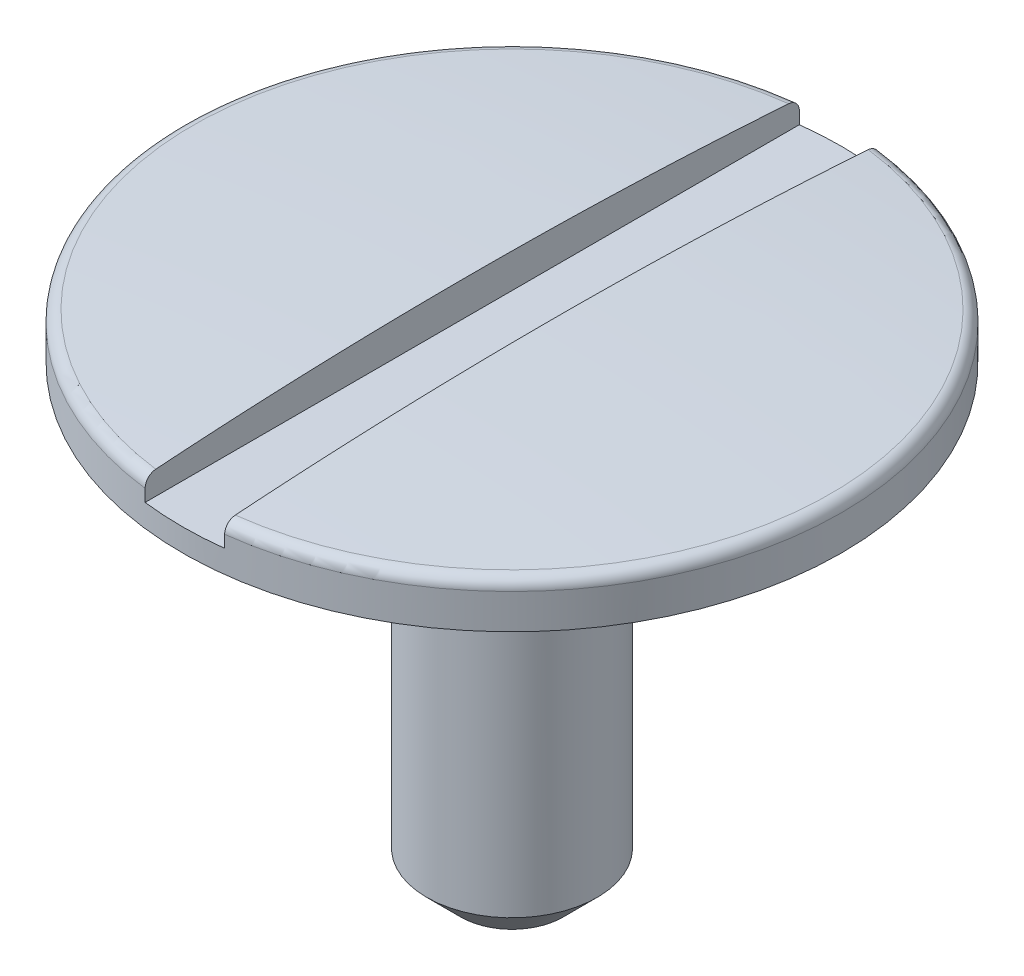
ISO-10303-21;
HEADER;
FILE_DESCRIPTION(('STEP AP214'),'2;1');
FILE_NAME('part.step','',(''),(''),'','','');
FILE_SCHEMA(('AUTOMOTIVE_DESIGN { 1 0 10303 214 1 1 1 1 }'));
ENDSEC;
DATA;
#1=APPLICATION_CONTEXT('core data for automotive mechanical design processes');
#2=APPLICATION_PROTOCOL_DEFINITION('international standard','automotive_design',2000,#1);
#3=PRODUCT_CONTEXT('',#1,'mechanical');
#4=PRODUCT('Part','Part','',(#3));
#5=PRODUCT_RELATED_PRODUCT_CATEGORY('part','',(#4));
#6=PRODUCT_DEFINITION_FORMATION('','',#4);
#7=PRODUCT_DEFINITION_CONTEXT('part definition',#1,'design');
#8=PRODUCT_DEFINITION('design','',#6,#7);
#9=PRODUCT_DEFINITION_SHAPE('','',#8);
#10=(LENGTH_UNIT() NAMED_UNIT(*) SI_UNIT(.MILLI.,.METRE.));
#11=(NAMED_UNIT(*) PLANE_ANGLE_UNIT() SI_UNIT($,.RADIAN.));
#12=(NAMED_UNIT(*) SI_UNIT($,.STERADIAN.) SOLID_ANGLE_UNIT());
#13=UNCERTAINTY_MEASURE_WITH_UNIT(LENGTH_MEASURE(1.E-05),#10,'distance_accuracy_value','');
#14=(GEOMETRIC_REPRESENTATION_CONTEXT(3) GLOBAL_UNCERTAINTY_ASSIGNED_CONTEXT((#13)) GLOBAL_UNIT_ASSIGNED_CONTEXT((#10,
#11,#12)) REPRESENTATION_CONTEXT('',''));
#15=CARTESIAN_POINT('',(0.,0.,0.));
#16=DIRECTION('',(0.,0.,1.));
#17=DIRECTION('',(1.,0.,0.));
#18=AXIS2_PLACEMENT_3D('',#15,#16,#17);
#19=CARTESIAN_POINT('',(0.,-19.7473682474656,0.));
#20=DIRECTION('',(0.,-1.,0.));
#21=DIRECTION('',(1.,0.,0.));
#22=AXIS2_PLACEMENT_3D('',#19,#20,#21);
#23=SPHERICAL_SURFACE('',#22,20.0000000000012);
#24=CARTESIAN_POINT('',(0.175000000002913,-19.7473682474656,0.));
#25=DIRECTION('',(1.,1.44957830461334E-13,0.));
#26=DIRECTION('',(-1.44957830461334E-13,1.,0.));
#27=AXIS2_PLACEMENT_3D('',#24,#25,#26);
#28=CIRCLE('',#27,19.9992343603461);
#29=CARTESIAN_POINT('',(0.175000000000021,0.203325051946489,1.39255587781734));
#30=VERTEX_POINT('',#29);
#31=CARTESIAN_POINT('',(0.175000000000021,0.203325051946445,-1.39255587781736));
#32=VERTEX_POINT('',#31);
#33=EDGE_CURVE('E109',#30,#32,#28,.F.);
#34=ORIENTED_EDGE('',*,*,#33,.F.);
#35=CARTESIAN_POINT('',(0.,0.203325051946444,0.));
#36=DIRECTION('',(0.,-1.,0.));
#37=DIRECTION('',(1.,0.,0.));
#38=AXIS2_PLACEMENT_3D('',#35,#36,#37);
#39=CIRCLE('',#38,1.40350877191546);
#40=EDGE_CURVE('E126',#30,#32,#39,.F.);
#41=ORIENTED_EDGE('',*,*,#40,.T.);
#42=EDGE_LOOP('',(#34,#41));
#43=FACE_BOUND('',#42,.T.);
#44=ADVANCED_FACE('F35',(#43),#23,.T.);
#45=CARTESIAN_POINT('',(0.,0.153448318697961,0.));
#46=DIRECTION('',(0.,-1.,0.));
#47=DIRECTION('',(1.,0.,0.));
#48=AXIS2_PLACEMENT_3D('',#45,#46,#47);
#49=TOROIDAL_SURFACE('',#48,1.39999999998568,0.05);
#50=CARTESIAN_POINT('',(0.175000000000024,0.180891636046044,-1.43113566144709));
#51=CARTESIAN_POINT('',(0.175000000000025,0.178560281061544,-1.43267770724129));
#52=CARTESIAN_POINT('',(0.175000000000025,0.176097582226159,-1.43402472347457));
#53=CARTESIAN_POINT('',(0.175000000000026,0.170979124220363,-1.43628758780099));
#54=CARTESIAN_POINT('',(0.175000000000026,0.168323150977832,-1.43720294913421));
#55=CARTESIAN_POINT('',(0.175000000000027,0.162895618780364,-1.43857383147017));
#56=CARTESIAN_POINT('',(0.175000000000028,0.160124094582384,-1.43902948972413));
#57=CARTESIAN_POINT('',(0.175000000000028,0.154544602146341,-1.43946763476279));
#58=CARTESIAN_POINT('',(0.175000000000029,0.151736642780538,-1.4394502346573));
#59=CARTESIAN_POINT('',(0.17500000000003,0.146170024697078,-1.43894369998403));
#60=CARTESIAN_POINT('',(0.17500000000003,0.14341126893163,-1.43845563124171));
#61=CARTESIAN_POINT('',(0.175000000000031,0.13801464336625,-1.43702370948892));
#62=CARTESIAN_POINT('',(0.175000000000031,0.13537677775096,-1.43607984071384));
#63=CARTESIAN_POINT('',(0.175000000000032,0.130293560142586,-1.4337627904083));
#64=CARTESIAN_POINT('',(0.175000000000032,0.127848414465937,-1.43238915640251));
#65=CARTESIAN_POINT('',(0.175000000000033,0.123221889741078,-1.42925288251512));
#66=CARTESIAN_POINT('',(0.175000000000033,0.121040516092855,-1.42749023467164));
#67=CARTESIAN_POINT('',(0.175000000000034,0.116991075627887,-1.42361656091314));
#68=CARTESIAN_POINT('',(0.175000000000034,0.115124687197054,-1.42150378071808));
#69=CARTESIAN_POINT('',(0.175000000000035,0.111770057388856,-1.41699680295985));
#70=CARTESIAN_POINT('',(0.175000000000035,0.110281829491109,-1.41460259536958));
#71=CARTESIAN_POINT('',(0.175000000000035,0.107714338923366,-1.40958218299511));
#72=CARTESIAN_POINT('',(0.175000000000035,0.10663811509622,-1.40695442408408));
#73=CARTESIAN_POINT('',(0.175000000000036,0.104938932971271,-1.40155622917851));
#74=CARTESIAN_POINT('',(0.175000000000036,0.104315992393513,-1.39878578761064));
#75=CARTESIAN_POINT('',(0.175000000000036,0.103537460797932,-1.39316193157017));
#76=CARTESIAN_POINT('',(0.175000000000036,0.103384877713837,-1.39030810041072));
#77=CARTESIAN_POINT('',(0.175000000000036,0.103559548266404,-1.38461512584935));
#78=CARTESIAN_POINT('',(0.175000000000036,0.103886812656071,-1.38177598277802));
#79=CARTESIAN_POINT('',(0.175000000000036,0.105013813089805,-1.3761849025975));
#80=CARTESIAN_POINT('',(0.175000000000035,0.105814840983795,-1.37343322568985));
#81=CARTESIAN_POINT('',(0.175000000000035,0.107868545203982,-1.36810385594301));
#82=CARTESIAN_POINT('',(0.175000000000035,0.109121219523854,-1.36552616233101));
#83=CARTESIAN_POINT('',(0.175000000000034,0.112040281181247,-1.36062493039321));
#84=CARTESIAN_POINT('',(0.175000000000034,0.11370568624035,-1.35830080722965));
#85=CARTESIAN_POINT('',(0.175000000000034,0.117405472671899,-1.35396752925418));
#86=CARTESIAN_POINT('',(0.175000000000033,0.119439841965097,-1.3519583641351));
#87=CARTESIAN_POINT('',(0.175000000000033,0.123805502865695,-1.34832671730377));
#88=CARTESIAN_POINT('',(0.175000000000032,0.126134717532373,-1.34670173917914));
#89=CARTESIAN_POINT('',(0.175000000000032,0.131034679756063,-1.34386963135274));
#90=CARTESIAN_POINT('',(0.175000000000031,0.133605416067243,-1.34266248220809));
#91=CARTESIAN_POINT('',(0.175000000000031,0.138893129670516,-1.34071036522845));
#92=CARTESIAN_POINT('',(0.17500000000003,0.141608758292212,-1.33996174364333));
#93=CARTESIAN_POINT('',(0.175000000000029,0.147127424117034,-1.33893393888391));
#94=CARTESIAN_POINT('',(0.175000000000029,0.149930458020146,-1.33865473800827));
#95=CARTESIAN_POINT('',(0.175000000000028,0.155527503093241,-1.3385744043236));
#96=CARTESIAN_POINT('',(0.175000000000028,0.158321476116973,-1.33877058680354));
#97=CARTESIAN_POINT('',(0.175000000000027,0.163836713163342,-1.33962951909531));
#98=CARTESIAN_POINT('',(0.175000000000027,0.16655797792858,-1.34029226414005));
#99=CARTESIAN_POINT('',(0.175000000000026,0.171849584425983,-1.34206416908961));
#100=CARTESIAN_POINT('',(0.175000000000025,0.174419995271844,-1.34317312270541));
#101=CARTESIAN_POINT('',(0.175000000000025,0.179339407662948,-1.34580479446419));
#102=CARTESIAN_POINT('',(0.175000000000024,0.181688405015702,-1.34732752043988));
#103=CARTESIAN_POINT('',(0.175000000000024,0.186111015737406,-1.35075096036927));
#104=CARTESIAN_POINT('',(0.175000000000023,0.188183224736419,-1.35265348818655));
#105=CARTESIAN_POINT('',(0.175000000000023,0.191981899679696,-1.35677700850719));
#106=CARTESIAN_POINT('',(0.175000000000023,0.193708351131309,-1.35899801435307));
#107=CARTESIAN_POINT('',(0.175000000000022,0.196780973781055,-1.36371412108633));
#108=CARTESIAN_POINT('',(0.175000000000022,0.198124044725907,-1.36621124184268));
#109=CARTESIAN_POINT('',(0.175000000000022,0.200375354166497,-1.37139435766703));
#110=CARTESIAN_POINT('',(0.175000000000022,0.20128357366268,-1.37408036098181));
#111=CARTESIAN_POINT('',(0.175000000000021,0.202645707273805,-1.37958580446009));
#112=CARTESIAN_POINT('',(0.175000000000021,0.203096298546881,-1.38240606709144));
#113=CARTESIAN_POINT('',(0.175000000000021,0.203519348037031,-1.38808215288261));
#114=CARTESIAN_POINT('',(0.175000000000021,0.203491812631285,-1.39093797556762));
#115=CARTESIAN_POINT('',(0.175000000000021,0.202958379659298,-1.39661400198807));
#116=CARTESIAN_POINT('',(0.175000000000021,0.20245092884452,-1.3994340599262));
#117=CARTESIAN_POINT('',(0.175000000000022,0.200968780987697,-1.40494946643022));
#118=CARTESIAN_POINT('',(0.175000000000022,0.199993969518579,-1.40764478427786));
#119=CARTESIAN_POINT('',(0.175000000000022,0.197605494651212,-1.41282894344985));
#120=CARTESIAN_POINT('',(0.175000000000022,0.196192400025502,-1.41531804710986));
#121=CARTESIAN_POINT('',(0.175000000000023,0.192966881760539,-1.42001948105551));
#122=CARTESIAN_POINT('',(0.175000000000023,0.191154951031286,-1.42223214773616));
#123=CARTESIAN_POINT('',(0.175000000000023,0.187918431007408,-1.42556201070716));
#124=CARTESIAN_POINT('',(0.175000000000024,0.186597857452183,-1.42678202620635));
#125=CARTESIAN_POINT('',(0.175000000000024,0.183833477621244,-1.42907342283929));
#126=CARTESIAN_POINT('',(0.175000000000024,0.182389671684978,-1.43014480438246));
#127=CARTESIAN_POINT('',(0.175000000000024,0.180891636046044,-1.43113566144709));
#128=B_SPLINE_CURVE_WITH_KNOTS('',3,(#50,#51,#52,#53,#54,#55,#56,#57,#58,#59,#60,#61,#62,#63,
#64,#65,#66,#67,#68,#69,#70,#71,#72,#73,#74,#75,#76,#77,#78,#79,#80,#81,#82,#83,#84,#85,#86,#87,
#88,#89,#90,#91,#92,#93,#94,#95,#96,#97,#98,#99,#100,#101,#102,#103,#104,#105,#106,#107,#108,
#109,#110,#111,#112,#113,#114,#115,#116,#117,#118,#119,#120,#121,#122,#123,#124,#125,#126,#127),
.UNSPECIFIED.,.T.,.F.,(4,2,2,2,2,2,2,2,2,2,2,2,2,2,2,2,2,2,2,2,2,2,2,2,2,2,2,2,2,2,2,2,2,2,2,2,
2,2,4),(0.,0.00837907339395287,0.0167675730710051,0.0251535674945092,0.0335375568167555,
0.0419026051341589,0.0502679427914296,0.0586421176436145,0.0670164639043773,0.0754341126133647,
0.0838520613292566,0.0923309545325715,0.100810179180546,0.10934351710766,0.117877046263093,
0.12643395247592,0.134990820677299,0.143527516309482,0.152063932515497,0.160543253791542,
0.169022180445353,0.177432633082565,0.185842768563927,0.194205518899811,0.202568183790649,
0.210926986928206,0.219285948308838,0.227685829073255,0.236086061850465,0.244552415110739,
0.253019138249669,0.261546908040078,0.270074564088494,0.278629914730998,0.287187361108461,
0.295733748383548,0.304269632143488,0.309653705020939,0.315037763068224),.UNSPECIFIED.);
#129=CARTESIAN_POINT('',(0.175000000000028,0.153448318698008,-1.4394009170341));
#130=VERTEX_POINT('',#129);
#131=EDGE_CURVE('E58',#32,#130,#128,.T.);
#132=ORIENTED_EDGE('',*,*,#131,.F.);
#133=ORIENTED_EDGE('',*,*,#40,.F.);
#134=CARTESIAN_POINT('',(0.175000000000025,0.175067090841669,1.34356634174732));
#135=CARTESIAN_POINT('',(0.175000000000026,0.172556157848946,1.34235227782851));
#136=CARTESIAN_POINT('',(0.175000000000026,0.169941282906867,1.34134869640238));
#137=CARTESIAN_POINT('',(0.175000000000027,0.164578095586884,1.33979383856907));
#138=CARTESIAN_POINT('',(0.175000000000027,0.161829636420155,1.33924307220805));
#139=CARTESIAN_POINT('',(0.175000000000028,0.156279928296398,1.33861163602454));
#140=CARTESIAN_POINT('',(0.175000000000028,0.153478697925862,1.33853080368167));
#141=CARTESIAN_POINT('',(0.175000000000029,0.147903271917639,1.33884137072952));
#142=CARTESIAN_POINT('',(0.17500000000003,0.145129070087395,1.33923265925875));
#143=CARTESIAN_POINT('',(0.17500000000003,0.139689197010661,1.3404747462751));
#144=CARTESIAN_POINT('',(0.175000000000031,0.137023395084223,1.34132497270266));
#145=CARTESIAN_POINT('',(0.175000000000032,0.131871564016762,1.34345943224581));
#146=CARTESIAN_POINT('',(0.175000000000032,0.129385543296285,1.34474368567428));
#147=CARTESIAN_POINT('',(0.175000000000033,0.124654292698374,1.34771378293724));
#148=CARTESIAN_POINT('',(0.175000000000033,0.122409924948726,1.34940099972761));
#149=CARTESIAN_POINT('',(0.175000000000034,0.118233694500287,1.35312574649911));
#150=CARTESIAN_POINT('',(0.175000000000034,0.116301842520982,1.35516328849168));
#151=CARTESIAN_POINT('',(0.175000000000034,0.112790160259404,1.35954674540898));
#152=CARTESIAN_POINT('',(0.175000000000035,0.111213024724992,1.3618948190153));
#153=CARTESIAN_POINT('',(0.175000000000035,0.108471780484804,1.36682079016142));
#154=CARTESIAN_POINT('',(0.175000000000035,0.107307688985756,1.3693986972701));
#155=CARTESIAN_POINT('',(0.175000000000035,0.105416411048964,1.37473271045428));
#156=CARTESIAN_POINT('',(0.175000000000036,0.104692691395389,1.37749004603199));
#157=CARTESIAN_POINT('',(0.175000000000036,0.103716003995072,1.38308689177576));
#158=CARTESIAN_POINT('',(0.175000000000036,0.103463051631074,1.38592640462397));
#159=CARTESIAN_POINT('',(0.175000000000036,0.103434772548715,1.39162125044477));
#160=CARTESIAN_POINT('',(0.175000000000036,0.10366170123626,1.39447659493407));
#161=CARTESIAN_POINT('',(0.175000000000036,0.10459179399141,1.40010868408785));
#162=CARTESIAN_POINT('',(0.175000000000035,0.105294960919559,1.40288542828011));
#163=CARTESIAN_POINT('',(0.175000000000035,0.10715826792202,1.40828033104081));
#164=CARTESIAN_POINT('',(0.175000000000035,0.108318282595621,1.41089853290039));
#165=CARTESIAN_POINT('',(0.175000000000035,0.111063496742903,1.41590169790733));
#166=CARTESIAN_POINT('',(0.175000000000034,0.112648687276086,1.41828666595763));
#167=CARTESIAN_POINT('',(0.175000000000034,0.116191366897031,1.42274279249504));
#168=CARTESIAN_POINT('',(0.175000000000034,0.118146991689346,1.42481543286268));
#169=CARTESIAN_POINT('',(0.175000000000033,0.122380707022045,1.42860003016995));
#170=CARTESIAN_POINT('',(0.175000000000033,0.124658785078175,1.43031200106704));
#171=CARTESIAN_POINT('',(0.175000000000032,0.129455047604575,1.43331344436886));
#172=CARTESIAN_POINT('',(0.175000000000032,0.131971371401962,1.43460589013499));
#173=CARTESIAN_POINT('',(0.175000000000031,0.137186290917626,1.43674680526891));
#174=CARTESIAN_POINT('',(0.17500000000003,0.139884879516075,1.43759529196781));
#175=CARTESIAN_POINT('',(0.17500000000003,0.145368875207367,1.43881891645228));
#176=CARTESIAN_POINT('',(0.175000000000029,0.148153604658957,1.43919709252355));
#177=CARTESIAN_POINT('',(0.175000000000028,0.153746946731911,1.43947893957385));
#178=CARTESIAN_POINT('',(0.175000000000028,0.156555558786953,1.43938262177324));
#179=CARTESIAN_POINT('',(0.175000000000027,0.162107722224546,1.4387194136826));
#180=CARTESIAN_POINT('',(0.175000000000027,0.164851449065259,1.43815399062373));
#181=CARTESIAN_POINT('',(0.175000000000026,0.170205235362731,1.43657117717517));
#182=CARTESIAN_POINT('',(0.175000000000026,0.172815294678449,1.4355537863086));
#183=CARTESIAN_POINT('',(0.175000000000025,0.177832092465727,1.43309504884698));
#184=CARTESIAN_POINT('',(0.175000000000025,0.180238529427037,1.43165308724508));
#185=CARTESIAN_POINT('',(0.175000000000024,0.184776861563309,1.42838768448682));
#186=CARTESIAN_POINT('',(0.175000000000024,0.186908750459584,1.42656423460865));
#187=CARTESIAN_POINT('',(0.175000000000023,0.19085015946654,1.4225773189605));
#188=CARTESIAN_POINT('',(0.175000000000023,0.192657863912135,1.42041205849629));
#189=CARTESIAN_POINT('',(0.175000000000022,0.19588723280272,1.41581063608749));
#190=CARTESIAN_POINT('',(0.175000000000022,0.197308881864106,1.413374463353));
#191=CARTESIAN_POINT('',(0.175000000000022,0.19973670970894,1.40828137823557));
#192=CARTESIAN_POINT('',(0.175000000000022,0.200739786888427,1.40562298728672));
#193=CARTESIAN_POINT('',(0.175000000000021,0.202288493763778,1.40017613028651));
#194=CARTESIAN_POINT('',(0.175000000000021,0.202834105517654,1.39738765913789));
#195=CARTESIAN_POINT('',(0.175000000000021,0.203455309129993,1.39174131798859));
#196=CARTESIAN_POINT('',(0.175000000000021,0.203527969275428,1.38888312515113));
#197=CARTESIAN_POINT('',(0.175000000000021,0.20319364384115,1.38319499960048));
#198=CARTESIAN_POINT('',(0.175000000000021,0.202786666749516,1.38036506638809));
#199=CARTESIAN_POINT('',(0.175000000000022,0.201502748924458,1.37480716258592));
#200=CARTESIAN_POINT('',(0.175000000000022,0.20062475804367,1.37207943446232));
#201=CARTESIAN_POINT('',(0.175000000000022,0.198421770971058,1.36680995287128));
#202=CARTESIAN_POINT('',(0.175000000000022,0.197096667322328,1.36426824428973));
#203=CARTESIAN_POINT('',(0.175000000000023,0.19403990709189,1.359450824216));
#204=CARTESIAN_POINT('',(0.175000000000023,0.192309194032555,1.35717451348824));
#205=CARTESIAN_POINT('',(0.175000000000023,0.188488877135831,1.35294953272031));
#206=CARTESIAN_POINT('',(0.175000000000024,0.186399720955243,1.35100045993137));
#207=CARTESIAN_POINT('',(0.175000000000024,0.182753424626422,1.3481379195084));
#208=CARTESIAN_POINT('',(0.175000000000024,0.181285900780818,1.34710828946503));
#209=CARTESIAN_POINT('',(0.175000000000025,0.178248900638886,1.34521229148411));
#210=CARTESIAN_POINT('',(0.175000000000025,0.176679424673388,1.34434592301684));
#211=CARTESIAN_POINT('',(0.175000000000025,0.175067090841669,1.34356634174732));
#212=B_SPLINE_CURVE_WITH_KNOTS('',3,(#134,#135,#136,#137,#138,#139,#140,#141,#142,#143,#144,
#145,#146,#147,#148,#149,#150,#151,#152,#153,#154,#155,#156,#157,#158,#159,#160,#161,#162,#163,
#164,#165,#166,#167,#168,#169,#170,#171,#172,#173,#174,#175,#176,#177,#178,#179,#180,#181,#182,
#183,#184,#185,#186,#187,#188,#189,#190,#191,#192,#193,#194,#195,#196,#197,#198,#199,#200,#201,
#202,#203,#204,#205,#206,#207,#208,#209,#210,#211),.UNSPECIFIED.,.T.,.F.,(4,2,2,2,2,2,2,2,2,2,2,
2,2,2,2,2,2,2,2,2,2,2,2,2,2,2,2,2,2,2,2,2,2,2,2,2,2,2,4),(0.,0.00836061225485666,
0.0167306289637,0.025097750842039,0.0334629083690153,0.0418176628436744,0.0501728083830814,
0.0585568377831628,0.0669411546997118,0.0753871630109144,0.0838335231274777,0.0923455439902202,
0.100857842986018,0.109410238059464,0.11796268450365,0.126512785010478,0.135062705741898,
0.143570688386908,0.152078341722883,0.160524309591593,0.16896994772522,0.177360737322396,
0.185751328503124,0.194115774742446,0.202480229807466,0.21085686121662,0.219233684158382,
0.227656050075539,0.23607875155941,0.244562801886651,0.253047184946369,0.261584110968788,
0.270120885916571,0.278676773590984,0.28723471901214,0.295772951277712,0.304300596814887,
0.309669175654578,0.315037737074358),.UNSPECIFIED.);
#213=CARTESIAN_POINT('',(0.175000000000028,0.153448318698118,1.43940091703489));
#214=VERTEX_POINT('',#213);
#215=EDGE_CURVE('E160',#214,#30,#212,.T.);
#216=ORIENTED_EDGE('',*,*,#215,.F.);
#217=CARTESIAN_POINT('',(0.,0.153448318698013,0.));
#218=DIRECTION('',(0.,-1.,0.));
#219=DIRECTION('',(1.,0.,0.));
#220=AXIS2_PLACEMENT_3D('',#217,#218,#219);
#221=CIRCLE('',#220,1.44999999998568);
#222=EDGE_CURVE('E123',#130,#214,#221,.T.);
#223=ORIENTED_EDGE('',*,*,#222,.F.);
#224=EDGE_LOOP('',(#132,#133,#216,#223));
#225=FACE_BOUND('',#224,.T.);
#226=ADVANCED_FACE('F176',(#225),#49,.T.);
#227=CARTESIAN_POINT('',(-0.175000000002913,-19.7473682474656,0.));
#228=DIRECTION('',(-1.,1.44957830461334E-13,0.));
#229=DIRECTION('',(-1.44957830461334E-13,-1.,0.));
#230=AXIS2_PLACEMENT_3D('',#227,#228,#229);
#231=CIRCLE('',#230,19.9992343603461);
#232=CARTESIAN_POINT('',(-0.175000000000021,0.203325051946444,-1.39255587781736));
#233=VERTEX_POINT('',#232);
#234=CARTESIAN_POINT('',(-0.175000000000021,0.203325051946444,1.39255587781735));
#235=VERTEX_POINT('',#234);
#236=EDGE_CURVE('E50',#233,#235,#231,.F.);
#237=ORIENTED_EDGE('',*,*,#236,.F.);
#238=EDGE_CURVE('E129',#233,#235,#39,.F.);
#239=ORIENTED_EDGE('',*,*,#238,.T.);
#240=EDGE_LOOP('',(#237,#239));
#241=FACE_BOUND('',#240,.T.);
#242=ADVANCED_FACE('F171',(#241),#23,.T.);
#243=CARTESIAN_POINT('',(2.96201993591808E-12,-848.356227187947,0.));
#244=DIRECTION('',(0.,-1.,0.));
#245=DIRECTION('',(1.,0.,0.));
#246=AXIS2_PLACEMENT_3D('',#243,#244,#245);
#247=CYLINDRICAL_SURFACE('',#246,1.44999999998568);
#248=DIRECTION('',(0.,-1.,0.));
#249=VECTOR('',#248,1.);
#250=CARTESIAN_POINT('',(-0.175000000123027,-848.356227187947,-1.43940091701873));
#251=LINE('',#250,#249);
#252=CARTESIAN_POINT('',(-0.175000000000036,0.1,-1.43940091701873));
#253=VERTEX_POINT('',#252);
#254=CARTESIAN_POINT('',(-0.175000000000028,0.153448318698012,-1.43940091703404));
#255=VERTEX_POINT('',#254);
#256=EDGE_CURVE('E97',#253,#255,#251,.F.);
#257=ORIENTED_EDGE('',*,*,#256,.F.);
#258=CARTESIAN_POINT('',(0.,0.099999999999989,0.));
#259=DIRECTION('',(0.,-1.,0.));
#260=DIRECTION('',(0.,0.,-1.));
#261=AXIS2_PLACEMENT_3D('',#258,#259,#260);
#262=CIRCLE('',#261,1.44999999998568);
#263=CARTESIAN_POINT('',(0.175000000000036,0.099999999999989,-1.43940091703404));
#264=VERTEX_POINT('',#263);
#265=EDGE_CURVE('E11',#264,#253,#262,.F.);
#266=ORIENTED_EDGE('',*,*,#265,.F.);
#267=DIRECTION('',(0.,-1.,0.));
#268=VECTOR('',#267,1.);
#269=CARTESIAN_POINT('',(0.175000000123027,-848.356227187947,-1.43940091701945));
#270=LINE('',#269,#268);
#271=EDGE_CURVE('E115',#130,#264,#270,.T.);
#272=ORIENTED_EDGE('',*,*,#271,.F.);
#273=ORIENTED_EDGE('',*,*,#222,.T.);
#274=DIRECTION('',(0.,-1.,0.));
#275=VECTOR('',#274,1.);
#276=CARTESIAN_POINT('',(0.175000000123027,-848.356227187947,1.43940091701945));
#277=LINE('',#276,#275);
#278=CARTESIAN_POINT('',(0.175000000000036,0.099999999999989,1.43940091703404));
#279=VERTEX_POINT('',#278);
#280=EDGE_CURVE('E107',#279,#214,#277,.F.);
#281=ORIENTED_EDGE('',*,*,#280,.F.);
#282=CARTESIAN_POINT('',(-0.175000000000036,0.1,1.43940091701873));
#283=VERTEX_POINT('',#282);
#284=EDGE_CURVE('E39',#283,#279,#262,.F.);
#285=ORIENTED_EDGE('',*,*,#284,.F.);
#286=DIRECTION('',(0.,-1.,0.));
#287=VECTOR('',#286,1.);
#288=CARTESIAN_POINT('',(-0.175000000123027,-848.356227187947,1.43940091701873));
#289=LINE('',#288,#287);
#290=CARTESIAN_POINT('',(-0.175000000000028,0.153448318700749,1.43940091703412));
#291=VERTEX_POINT('',#290);
#292=EDGE_CURVE('E100',#291,#283,#289,.T.);
#293=ORIENTED_EDGE('',*,*,#292,.F.);
#294=EDGE_CURVE('E106',#291,#255,#221,.T.);
#295=ORIENTED_EDGE('',*,*,#294,.T.);
#296=EDGE_LOOP('',(#257,#266,#272,#273,#281,#285,#293,#295));
#297=FACE_BOUND('',#296,.T.);
#298=CARTESIAN_POINT('',(0.,0.,0.));
#299=DIRECTION('',(0.,-1.,0.));
#300=DIRECTION('',(1.,0.,0.));
#301=AXIS2_PLACEMENT_3D('',#298,#299,#300);
#302=CIRCLE('',#301,1.44999999998281);
#303=CARTESIAN_POINT('',(1.44999999998281,0.,0.));
#304=VERTEX_POINT('',#303);
#305=EDGE_CURVE('E117',#304,#304,#302,.T.);
#306=ORIENTED_EDGE('',*,*,#305,.F.);
#307=EDGE_LOOP('',(#306));
#308=FACE_BOUND('',#307,.T.);
#309=ADVANCED_FACE('F103',(#297,#308),#247,.T.);
#310=CARTESIAN_POINT('',(0.,0.,0.));
#311=DIRECTION('',(0.,-1.,0.));
#312=DIRECTION('',(1.,0.,0.));
#313=AXIS2_PLACEMENT_3D('',#310,#311,#312);
#314=PLANE('',#313);
#315=CARTESIAN_POINT('',(0.,0.,0.));
#316=DIRECTION('',(0.,-1.,0.));
#317=DIRECTION('',(1.,0.,0.));
#318=AXIS2_PLACEMENT_3D('',#315,#316,#317);
#319=CIRCLE('',#318,0.375);
#320=CARTESIAN_POINT('',(0.375,0.,0.));
#321=VERTEX_POINT('',#320);
#322=EDGE_CURVE('E120',#321,#321,#319,.T.);
#323=ORIENTED_EDGE('',*,*,#322,.F.);
#324=EDGE_LOOP('',(#323));
#325=FACE_BOUND('',#324,.T.);
#326=ORIENTED_EDGE('',*,*,#305,.T.);
#327=EDGE_LOOP('',(#326));
#328=FACE_BOUND('',#327,.T.);
#329=ADVANCED_FACE('F188',(#325,#328),#314,.T.);
#330=CARTESIAN_POINT('',(0.,-2.,0.));
#331=DIRECTION('',(0.,1.,0.));
#332=DIRECTION('',(0.,0.,1.));
#333=AXIS2_PLACEMENT_3D('',#330,#331,#332);
#334=CYLINDRICAL_SURFACE('',#333,0.375);
#335=CARTESIAN_POINT('',(0.,-1.85,0.));
#336=DIRECTION('',(0.,1.,0.));
#337=DIRECTION('',(0.,0.,1.));
#338=AXIS2_PLACEMENT_3D('',#335,#336,#337);
#339=CIRCLE('',#338,0.375);
#340=CARTESIAN_POINT('',(0.,-1.85,0.375));
#341=VERTEX_POINT('',#340);
#342=EDGE_CURVE('E130',#341,#341,#339,.T.);
#343=ORIENTED_EDGE('',*,*,#342,.T.);
#344=EDGE_LOOP('',(#343));
#345=FACE_BOUND('',#344,.T.);
#346=ORIENTED_EDGE('',*,*,#322,.T.);
#347=EDGE_LOOP('',(#346));
#348=FACE_BOUND('',#347,.T.);
#349=ADVANCED_FACE('F192',(#345,#348),#334,.T.);
#350=CARTESIAN_POINT('',(0.,-2.,0.));
#351=DIRECTION('',(0.,1.,0.));
#352=DIRECTION('',(0.,0.,1.));
#353=AXIS2_PLACEMENT_3D('',#350,#351,#352);
#354=PLANE('',#353);
#355=CARTESIAN_POINT('',(0.,-2.,0.));
#356=DIRECTION('',(0.,1.,0.));
#357=DIRECTION('',(0.,0.,1.));
#358=AXIS2_PLACEMENT_3D('',#355,#356,#357);
#359=CIRCLE('',#358,0.224999999999999);
#360=CARTESIAN_POINT('',(0.,-2.,0.224999999999999));
#361=VERTEX_POINT('',#360);
#362=EDGE_CURVE('E133',#361,#361,#359,.F.);
#363=ORIENTED_EDGE('',*,*,#362,.T.);
#364=EDGE_LOOP('',(#363));
#365=FACE_BOUND('',#364,.T.);
#366=ADVANCED_FACE('F157',(#365),#354,.F.);
#367=CARTESIAN_POINT('',(-0.175000000000024,0.180891636046044,-1.43113566144709));
#368=CARTESIAN_POINT('',(-0.175000000000024,0.183245146175823,-1.42957865814561));
#369=CARTESIAN_POINT('',(-0.175000000000024,0.185468214655313,-1.42782059027519));
#370=CARTESIAN_POINT('',(-0.175000000000023,0.189588780622375,-1.42395399521058));
#371=CARTESIAN_POINT('',(-0.175000000000023,0.191485855487181,-1.42184501995964));
#372=CARTESIAN_POINT('',(-0.175000000000022,0.19489832449156,-1.41734050037786));
#373=CARTESIAN_POINT('',(-0.175000000000022,0.196414019684757,-1.41494518429622));
#374=CARTESIAN_POINT('',(-0.175000000000022,0.199023765533317,-1.40993586938822));
#375=CARTESIAN_POINT('',(-0.175000000000022,0.200117920150735,-1.40732192467474));
#376=CARTESIAN_POINT('',(-0.175000000000021,0.201860586806894,-1.40193390635059));
#377=CARTESIAN_POINT('',(-0.175000000000021,0.202506668002042,-1.39915904643895));
#378=CARTESIAN_POINT('',(-0.175000000000021,0.203326376098828,-1.39354026424632));
#379=CARTESIAN_POINT('',(-0.175000000000021,0.203499968427231,-1.39069633692685));
#380=CARTESIAN_POINT('',(-0.175000000000021,0.203369781384107,-1.38500536118466));
#381=CARTESIAN_POINT('',(-0.175000000000021,0.203063647460291,-1.38215836633464));
#382=CARTESIAN_POINT('',(-0.175000000000021,0.201977990364129,-1.37655606909352));
#383=CARTESIAN_POINT('',(-0.175000000000022,0.201198462959194,-1.37380076752246));
#384=CARTESIAN_POINT('',(-0.175000000000022,0.199186898737186,-1.3684593851795));
#385=CARTESIAN_POINT('',(-0.175000000000022,0.197954696444945,-1.36587336669677));
#386=CARTESIAN_POINT('',(-0.175000000000022,0.195071680046816,-1.36094621107579));
#387=CARTESIAN_POINT('',(-0.175000000000023,0.193420874668266,-1.35860506883363));
#388=CARTESIAN_POINT('',(-0.175000000000023,0.18975521363733,-1.35424629047737));
#389=CARTESIAN_POINT('',(-0.175000000000023,0.187742093979376,-1.35222719474485));
#390=CARTESIAN_POINT('',(-0.175000000000024,0.183403102412896,-1.34855887108132));
#391=CARTESIAN_POINT('',(-0.175000000000024,0.181077243256788,-1.34690962807633));
#392=CARTESIAN_POINT('',(-0.175000000000025,0.176198220572337,-1.34404164268271));
#393=CARTESIAN_POINT('',(-0.175000000000026,0.173646975787383,-1.34281963618264));
#394=CARTESIAN_POINT('',(-0.175000000000026,0.168374503349626,-1.34082492972899));
#395=CARTESIAN_POINT('',(-0.175000000000027,0.165653283452889,-1.34005220929078));
#396=CARTESIAN_POINT('',(-0.175000000000028,0.160139650361024,-1.3389833929124));
#397=CARTESIAN_POINT('',(-0.175000000000028,0.157347909298497,-1.33868382776914));
#398=CARTESIAN_POINT('',(-0.175000000000029,0.151753903237082,-1.33855940210955));
#399=CARTESIAN_POINT('',(-0.175000000000029,0.148951638514065,-1.33873452923501));
#400=CARTESIAN_POINT('',(-0.17500000000003,0.143426022912686,-1.33955280663568));
#401=CARTESIAN_POINT('',(-0.17500000000003,0.140702438008793,-1.34019437838027));
#402=CARTESIAN_POINT('',(-0.175000000000031,0.135401274168418,-1.34192467402709));
#403=CARTESIAN_POINT('',(-0.175000000000031,0.132823695882744,-1.34301339992226));
#404=CARTESIAN_POINT('',(-0.175000000000032,0.127881062371418,-1.34560889856114));
#405=CARTESIAN_POINT('',(-0.175000000000033,0.125516497914748,-1.34711660555631));
#406=CARTESIAN_POINT('',(-0.175000000000033,0.121071860831305,-1.35050510514726));
#407=CARTESIAN_POINT('',(-0.175000000000033,0.11899179719771,-1.35238590953218));
#408=CARTESIAN_POINT('',(-0.175000000000034,0.115159996023456,-1.35648050653083));
#409=CARTESIAN_POINT('',(-0.175000000000034,0.113410563493263,-1.35869645597305));
#410=CARTESIAN_POINT('',(-0.175000000000035,0.110305035659722,-1.36338865900591));
#411=CARTESIAN_POINT('',(-0.175000000000035,0.10894895737954,-1.36586492385587));
#412=CARTESIAN_POINT('',(-0.175000000000035,0.106657378111048,-1.37102878830448));
#413=CARTESIAN_POINT('',(-0.175000000000035,0.105725334766836,-1.373717922521));
#414=CARTESIAN_POINT('',(-0.175000000000036,0.104323069037552,-1.37921403486717));
#415=CARTESIAN_POINT('',(-0.175000000000036,0.10385286342028,-1.38202101727163));
#416=CARTESIAN_POINT('',(-0.175000000000036,0.103385676901511,-1.38769014963537));
#417=CARTESIAN_POINT('',(-0.175000000000036,0.103391389579916,-1.3905525219228));
#418=CARTESIAN_POINT('',(-0.175000000000036,0.103882763062926,-1.39623581035699));
#419=CARTESIAN_POINT('',(-0.175000000000036,0.104368429517785,-1.3990567260153));
#420=CARTESIAN_POINT('',(-0.175000000000035,0.105807369404984,-1.40457951914757));
#421=CARTESIAN_POINT('',(-0.175000000000035,0.106761074042997,-1.40728128434122));
#422=CARTESIAN_POINT('',(-0.175000000000035,0.10911030638354,-1.41248543196174));
#423=CARTESIAN_POINT('',(-0.175000000000035,0.110505828158897,-1.41498781706281));
#424=CARTESIAN_POINT('',(-0.175000000000034,0.11369367852166,-1.4197110913627));
#425=CARTESIAN_POINT('',(-0.175000000000034,0.115484401746047,-1.4219330638195));
#426=CARTESIAN_POINT('',(-0.175000000000033,0.119415860238713,-1.42604219148294));
#427=CARTESIAN_POINT('',(-0.175000000000033,0.121556583566387,-1.42792935810724));
#428=CARTESIAN_POINT('',(-0.175000000000032,0.126111388096289,-1.43130118146139));
#429=CARTESIAN_POINT('',(-0.175000000000032,0.128523463197131,-1.43278854803238));
#430=CARTESIAN_POINT('',(-0.175000000000031,0.133564332959338,-1.43533385978036));
#431=CARTESIAN_POINT('',(-0.175000000000031,0.136193110194246,-1.43639183944675));
#432=CARTESIAN_POINT('',(-0.17500000000003,0.141572910580311,-1.43804100000422));
#433=CARTESIAN_POINT('',(-0.17500000000003,0.144322942525437,-1.43863541559851));
#434=CARTESIAN_POINT('',(-0.175000000000029,0.149884608756212,-1.43935213307851));
#435=CARTESIAN_POINT('',(-0.175000000000029,0.152696256710534,-1.43947432912041));
#436=CARTESIAN_POINT('',(-0.175000000000028,0.158289538548003,-1.43924324835924));
#437=CARTESIAN_POINT('',(-0.175000000000027,0.161071243821245,-1.43889167097958));
#438=CARTESIAN_POINT('',(-0.175000000000027,0.166533684299149,-1.43772652925779));
#439=CARTESIAN_POINT('',(-0.175000000000026,0.169214538966182,-1.43691353112332));
#440=CARTESIAN_POINT('',(-0.175000000000026,0.173397440779251,-1.43525039404146));
#441=CARTESIAN_POINT('',(-0.175000000000025,0.174954835601789,-1.43453590050758));
#442=CARTESIAN_POINT('',(-0.175000000000025,0.177988034915014,-1.43295082505942));
#443=CARTESIAN_POINT('',(-0.175000000000025,0.17946383965127,-1.43208024361497));
#444=CARTESIAN_POINT('',(-0.175000000000024,0.180891636046044,-1.43113566144709));
#445=B_SPLINE_CURVE_WITH_KNOTS('',3,(#367,#368,#369,#370,#371,#372,#373,#374,#375,#376,#377,
#378,#379,#380,#381,#382,#383,#384,#385,#386,#387,#388,#389,#390,#391,#392,#393,#394,#395,#396,
#397,#398,#399,#400,#401,#402,#403,#404,#405,#406,#407,#408,#409,#410,#411,#412,#413,#414,#415,
#416,#417,#418,#419,#420,#421,#422,#423,#424,#425,#426,#427,#428,#429,#430,#431,#432,#433,#434,
#435,#436,#437,#438,#439,#440,#441,#442,#443,#444),.UNSPECIFIED.,.T.,.F.,(4,2,2,2,2,2,2,2,2,2,2,
2,2,2,2,2,2,2,2,2,2,2,2,2,2,2,2,2,2,2,2,2,2,2,2,2,2,2,4),(0.,0.00845947261381736,
0.0169298307987472,0.0253934815235086,0.0338550435700035,0.0423621587299338,0.0508698963607686,
0.0594195219212486,0.0679692239246541,0.0765220543839314,0.0850747065423118,0.0935874205782733,
0.10209978760092,0.110545620477339,0.118991068246535,0.127374301160515,0.135757315826122,
0.144112092172698,0.152466905756734,0.160840500638811,0.169214360152233,0.177644603088571,
0.186075210805551,0.194573382263658,0.203071862250853,0.211618444783638,0.220165127932238,
0.228719700002417,0.23727415731408,0.245794484710806,0.254314521488615,0.262775263573696,
0.271235325936779,0.279635813080006,0.288038183008569,0.29641049375583,0.304772553016528,
0.309904649412704,0.315036730361443),.UNSPECIFIED.);
#446=EDGE_CURVE('E141',#255,#233,#445,.T.);
#447=ORIENTED_EDGE('',*,*,#446,.F.);
#448=ORIENTED_EDGE('',*,*,#294,.F.);
#449=CARTESIAN_POINT('',(-0.175000000000025,0.175067090841669,1.34356634174732));
#450=CARTESIAN_POINT('',(-0.175000000000025,0.177601634880067,1.34479210412758));
#451=CARTESIAN_POINT('',(-0.175000000000025,0.180033960001328,1.34623415073661));
#452=CARTESIAN_POINT('',(-0.175000000000024,0.184623311283032,1.34950824322784));
#453=CARTESIAN_POINT('',(-0.175000000000024,0.186779978952231,1.35134078885997));
#454=CARTESIAN_POINT('',(-0.175000000000023,0.190754070704036,1.3553399632431));
#455=CARTESIAN_POINT('',(-0.175000000000023,0.192571772521511,1.35750631580429));
#456=CARTESIAN_POINT('',(-0.175000000000022,0.195819687238919,1.36211124582551));
#457=CARTESIAN_POINT('',(-0.175000000000022,0.19724999452784,1.36454975676911));
#458=CARTESIAN_POINT('',(-0.175000000000022,0.199692623159323,1.36964587064869));
#459=CARTESIAN_POINT('',(-0.175000000000022,0.200702386124819,1.37230469990102));
#460=CARTESIAN_POINT('',(-0.175000000000021,0.202264260878997,1.37775367101632));
#461=CARTESIAN_POINT('',(-0.175000000000021,0.202816337408834,1.38054382297851));
#462=CARTESIAN_POINT('',(-0.175000000000021,0.203449763157484,1.38619400877083));
#463=CARTESIAN_POINT('',(-0.175000000000021,0.203528278390251,1.38905436066358));
#464=CARTESIAN_POINT('',(-0.175000000000021,0.203204738055843,1.39474779192876));
#465=CARTESIAN_POINT('',(-0.175000000000021,0.202802675912263,1.39758087092744));
#466=CARTESIAN_POINT('',(-0.175000000000022,0.201527817715506,1.40314325411102));
#467=CARTESIAN_POINT('',(-0.175000000000022,0.200654372316191,1.40587240957278));
#468=CARTESIAN_POINT('',(-0.175000000000022,0.19846007280553,1.41114455630845));
#469=CARTESIAN_POINT('',(-0.175000000000022,0.197139225419435,1.41368755038));
#470=CARTESIAN_POINT('',(-0.175000000000023,0.194092113248477,1.41850497457802));
#471=CARTESIAN_POINT('',(-0.175000000000023,0.192367328746131,1.42078034078569));
#472=CARTESIAN_POINT('',(-0.175000000000023,0.188557823788917,1.42500669723618));
#473=CARTESIAN_POINT('',(-0.175000000000024,0.186473115438264,1.42695769838303));
#474=CARTESIAN_POINT('',(-0.175000000000024,0.1820180854933,1.43046557674846));
#475=CARTESIAN_POINT('',(-0.175000000000025,0.179649812160618,1.43202505514176));
#476=CARTESIAN_POINT('',(-0.175000000000025,0.174683600994688,1.43472096536138));
#477=CARTESIAN_POINT('',(-0.175000000000026,0.172085672657897,1.43585741467024));
#478=CARTESIAN_POINT('',(-0.175000000000027,0.166753653613356,1.43766686636495));
#479=CARTESIAN_POINT('',(-0.175000000000027,0.164020654516177,1.43834308614851));
#480=CARTESIAN_POINT('',(-0.175000000000028,0.158479770503276,1.43922483177006));
#481=CARTESIAN_POINT('',(-0.175000000000028,0.155671887812569,1.43943037157763));
#482=CARTESIAN_POINT('',(-0.175000000000029,0.150074102517257,1.43936479432936));
#483=CARTESIAN_POINT('',(-0.175000000000029,0.147284175144606,1.4390957694349));
#484=CARTESIAN_POINT('',(-0.17500000000003,0.141789141886287,1.43809309524229));
#485=CARTESIAN_POINT('',(-0.175000000000031,0.139084035371802,1.43735944938945));
#486=CARTESIAN_POINT('',(-0.175000000000031,0.133835152577802,1.43544917907959));
#487=CARTESIAN_POINT('',(-0.175000000000032,0.131291373758234,1.43427256159904));
#488=CARTESIAN_POINT('',(-0.175000000000032,0.126436300142272,1.4315107354197));
#489=CARTESIAN_POINT('',(-0.175000000000033,0.124125009353732,1.42992551967876));
#490=CARTESIAN_POINT('',(-0.175000000000033,0.119789427760295,1.42638457648963));
#491=CARTESIAN_POINT('',(-0.175000000000034,0.117766426774678,1.4244272700603));
#492=CARTESIAN_POINT('',(-0.175000000000034,0.114074961313065,1.42020289484204));
#493=CARTESIAN_POINT('',(-0.175000000000034,0.112406509176307,1.41793581527671));
#494=CARTESIAN_POINT('',(-0.175000000000035,0.109458992513398,1.41313933450241));
#495=CARTESIAN_POINT('',(-0.175000000000035,0.10818273506982,1.41060820834382));
#496=CARTESIAN_POINT('',(-0.175000000000035,0.106069957744657,1.40536864547964));
#497=CARTESIAN_POINT('',(-0.175000000000035,0.105233455363816,1.40266020172224));
#498=CARTESIAN_POINT('',(-0.175000000000036,0.104018328842871,1.39712296708515));
#499=CARTESIAN_POINT('',(-0.175000000000036,0.103642883749184,1.39429347832423));
#500=CARTESIAN_POINT('',(-0.175000000000036,0.103370371198427,1.38861153249208));
#501=CARTESIAN_POINT('',(-0.175000000000036,0.103473316473458,1.38575907481156));
#502=CARTESIAN_POINT('',(-0.175000000000036,0.104156010697789,1.38010076582265));
#503=CARTESIAN_POINT('',(-0.175000000000036,0.104737564639843,1.37729513203733));
#504=CARTESIAN_POINT('',(-0.175000000000035,0.10636394409124,1.37182145296135));
#505=CARTESIAN_POINT('',(-0.175000000000035,0.107408771615954,1.3691534082693));
#506=CARTESIAN_POINT('',(-0.175000000000035,0.109931628684279,1.36403438665374));
#507=CARTESIAN_POINT('',(-0.175000000000035,0.111409160344082,1.36158316444446));
#508=CARTESIAN_POINT('',(-0.175000000000034,0.114757066396075,1.35696546293372));
#509=CARTESIAN_POINT('',(-0.175000000000034,0.116627430956051,1.35479897650781));
#510=CARTESIAN_POINT('',(-0.175000000000033,0.120696578053263,1.35082622334201));
#511=CARTESIAN_POINT('',(-0.175000000000033,0.122893374471638,1.34901792263253));
#512=CARTESIAN_POINT('',(-0.175000000000032,0.127561375638576,1.34579946054257));
#513=CARTESIAN_POINT('',(-0.175000000000032,0.130032557066825,1.34438926536265));
#514=CARTESIAN_POINT('',(-0.175000000000031,0.135157493786466,1.34201908721952));
#515=CARTESIAN_POINT('',(-0.175000000000031,0.137809586159128,1.34105550800612));
#516=CARTESIAN_POINT('',(-0.17500000000003,0.143239239177258,1.33959036707827));
#517=CARTESIAN_POINT('',(-0.17500000000003,0.146016826198256,1.33908890296605));
#518=CARTESIAN_POINT('',(-0.175000000000029,0.151599560059721,1.33856501988213));
#519=CARTESIAN_POINT('',(-0.175000000000028,0.154404439133314,1.33853972596745));
#520=CARTESIAN_POINT('',(-0.175000000000028,0.159976002619435,1.33896179573472));
#521=CARTESIAN_POINT('',(-0.175000000000027,0.162742730115278,1.33940857283488));
#522=CARTESIAN_POINT('',(-0.175000000000026,0.167107814503019,1.34049687567487));
#523=CARTESIAN_POINT('',(-0.175000000000026,0.168743130893495,1.34099566009447));
#524=CARTESIAN_POINT('',(-0.175000000000026,0.171953871458242,1.34215853742647));
#525=CARTESIAN_POINT('',(-0.175000000000026,0.173529295900001,1.34282262960047));
#526=CARTESIAN_POINT('',(-0.175000000000025,0.175067090841669,1.34356634174732));
#527=B_SPLINE_CURVE_WITH_KNOTS('',3,(#449,#450,#451,#452,#453,#454,#455,#456,#457,#458,#459,
#460,#461,#462,#463,#464,#465,#466,#467,#468,#469,#470,#471,#472,#473,#474,#475,#476,#477,#478,
#479,#480,#481,#482,#483,#484,#485,#486,#487,#488,#489,#490,#491,#492,#493,#494,#495,#496,#497,
#498,#499,#500,#501,#502,#503,#504,#505,#506,#507,#508,#509,#510,#511,#512,#513,#514,#515,#516,
#517,#518,#519,#520,#521,#522,#523,#524,#525,#526),.UNSPECIFIED.,.T.,.F.,(4,2,2,2,2,2,2,2,2,2,2,
2,2,2,2,2,2,2,2,2,2,2,2,2,2,2,2,2,2,2,2,2,2,2,2,2,2,2,4),(0.,0.0084398641346356,
0.0168905949502175,0.0253343708603596,0.0337760875831991,0.0422684346309832,0.0507614358439434,
0.0593052126468733,0.0678491063674378,0.0764047997402214,0.0849603645113529,0.0934850537493285,
0.102009456358428,0.110475629866172,0.118941453453029,0.127347468452697,0.135753233962213,
0.144122034453101,0.152490772887642,0.160859379526416,0.169228130406675,0.177633220874318,
0.186038603813488,0.19450281659582,0.202967366199313,0.211489958017946,0.220012776662051,
0.228567885787494,0.237123032130476,0.24566837305601,0.254213500125693,0.26270861709827,
0.271203012612393,0.279627767378507,0.288054301109334,0.296429942058791,0.304795187904392,
0.309915966297191,0.315036721816912),.UNSPECIFIED.);
#528=EDGE_CURVE('E136',#235,#291,#527,.T.);
#529=ORIENTED_EDGE('',*,*,#528,.F.);
#530=ORIENTED_EDGE('',*,*,#238,.F.);
#531=EDGE_LOOP('',(#447,#448,#529,#530));
#532=FACE_BOUND('',#531,.T.);
#533=ADVANCED_FACE('F145',(#532),#49,.T.);
#534=CARTESIAN_POINT('',(0.,-1.85,0.));
#535=DIRECTION('',(0.,1.,0.));
#536=DIRECTION('',(0.,0.,1.));
#537=AXIS2_PLACEMENT_3D('',#534,#535,#536);
#538=CONICAL_SURFACE('',#537,0.375,0.785398163397453);
#539=ORIENTED_EDGE('',*,*,#362,.F.);
#540=EDGE_LOOP('',(#539));
#541=FACE_BOUND('',#540,.T.);
#542=ORIENTED_EDGE('',*,*,#342,.F.);
#543=EDGE_LOOP('',(#542));
#544=FACE_BOUND('',#543,.T.);
#545=ADVANCED_FACE('F37',(#541,#544),#538,.T.);
#546=CARTESIAN_POINT('',(0.175,0.349999999999961,-1.44999999998567));
#547=DIRECTION('',(1.,1.44957830461334E-13,0.));
#548=DIRECTION('',(-1.44957830461334E-13,1.,0.));
#549=AXIS2_PLACEMENT_3D('',#546,#547,#548);
#550=PLANE('',#549);
#551=ORIENTED_EDGE('',*,*,#271,.T.);
#552=DIRECTION('',(0.,0.,1.));
#553=VECTOR('',#552,1.);
#554=CARTESIAN_POINT('',(0.175000000000036,0.1,-1.44999999998567));
#555=LINE('',#554,#553);
#556=EDGE_CURVE('E92',#264,#279,#555,.T.);
#557=ORIENTED_EDGE('',*,*,#556,.T.);
#558=ORIENTED_EDGE('',*,*,#280,.T.);
#559=ORIENTED_EDGE('',*,*,#215,.T.);
#560=ORIENTED_EDGE('',*,*,#33,.T.);
#561=ORIENTED_EDGE('',*,*,#131,.T.);
#562=EDGE_LOOP('',(#551,#557,#558,#559,#560,#561));
#563=FACE_BOUND('',#562,.T.);
#564=ADVANCED_FACE('F152',(#563),#550,.F.);
#565=CARTESIAN_POINT('',(0.175000000000036,0.1,-1.44999999998567));
#566=DIRECTION('',(0.,-1.,0.));
#567=DIRECTION('',(0.,0.,-1.));
#568=AXIS2_PLACEMENT_3D('',#565,#566,#567);
#569=PLANE('',#568);
#570=DIRECTION('',(0.,0.,1.));
#571=VECTOR('',#570,1.);
#572=CARTESIAN_POINT('',(-0.175000000000036,0.1,-1.44999999998567));
#573=LINE('',#572,#571);
#574=EDGE_CURVE('E90',#253,#283,#573,.T.);
#575=ORIENTED_EDGE('',*,*,#574,.T.);
#576=ORIENTED_EDGE('',*,*,#284,.T.);
#577=ORIENTED_EDGE('',*,*,#556,.F.);
#578=ORIENTED_EDGE('',*,*,#265,.T.);
#579=EDGE_LOOP('',(#575,#576,#577,#578));
#580=FACE_BOUND('',#579,.T.);
#581=ADVANCED_FACE('F89',(#580),#569,.F.);
#582=CARTESIAN_POINT('',(-0.175,0.349999999999961,-1.44999999998567));
#583=DIRECTION('',(-1.,1.44957830461334E-13,0.));
#584=DIRECTION('',(-1.44957830461334E-13,-1.,0.));
#585=AXIS2_PLACEMENT_3D('',#582,#583,#584);
#586=PLANE('',#585);
#587=ORIENTED_EDGE('',*,*,#256,.T.);
#588=ORIENTED_EDGE('',*,*,#446,.T.);
#589=ORIENTED_EDGE('',*,*,#236,.T.);
#590=ORIENTED_EDGE('',*,*,#528,.T.);
#591=ORIENTED_EDGE('',*,*,#292,.T.);
#592=ORIENTED_EDGE('',*,*,#574,.F.);
#593=EDGE_LOOP('',(#587,#588,#589,#590,#591,#592));
#594=FACE_BOUND('',#593,.T.);
#595=ADVANCED_FACE('F96',(#594),#586,.F.);
#596=CLOSED_SHELL('',(#44,#226,#242,#309,#329,#349,#366,#533,#545,#564,#581,#595));
#597=MANIFOLD_SOLID_BREP('B2',#596);
#598=ADVANCED_BREP_SHAPE_REPRESENTATION('',(#18,#597),#14);
#599=SHAPE_DEFINITION_REPRESENTATION(#9,#598);
ENDSEC;
END-ISO-10303-21;
